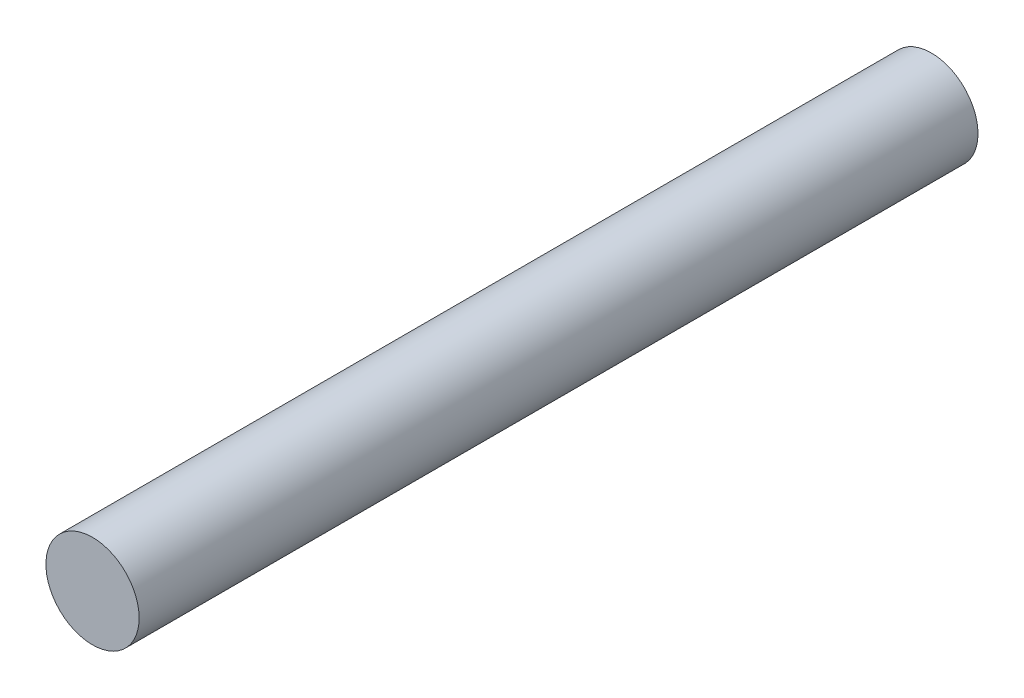
ISO-10303-21;
HEADER;
FILE_DESCRIPTION(('STEP AP214'),'2;1');
FILE_NAME('part.step','',(''),(''),'','','');
FILE_SCHEMA(('AUTOMOTIVE_DESIGN { 1 0 10303 214 1 1 1 1 }'));
ENDSEC;
DATA;
#1=APPLICATION_CONTEXT('core data for automotive mechanical design processes');
#2=APPLICATION_PROTOCOL_DEFINITION('international standard','automotive_design',2000,#1);
#3=PRODUCT_CONTEXT('',#1,'mechanical');
#4=PRODUCT('Part','Part','',(#3));
#5=PRODUCT_RELATED_PRODUCT_CATEGORY('part','',(#4));
#6=PRODUCT_DEFINITION_FORMATION('','',#4);
#7=PRODUCT_DEFINITION_CONTEXT('part definition',#1,'design');
#8=PRODUCT_DEFINITION('design','',#6,#7);
#9=PRODUCT_DEFINITION_SHAPE('','',#8);
#10=(LENGTH_UNIT() NAMED_UNIT(*) SI_UNIT(.MILLI.,.METRE.));
#11=(NAMED_UNIT(*) PLANE_ANGLE_UNIT() SI_UNIT($,.RADIAN.));
#12=(NAMED_UNIT(*) SI_UNIT($,.STERADIAN.) SOLID_ANGLE_UNIT());
#13=UNCERTAINTY_MEASURE_WITH_UNIT(LENGTH_MEASURE(1.E-05),#10,'distance_accuracy_value','');
#14=(GEOMETRIC_REPRESENTATION_CONTEXT(3) GLOBAL_UNCERTAINTY_ASSIGNED_CONTEXT((#13)) GLOBAL_UNIT_ASSIGNED_CONTEXT((#10,
#11,#12)) REPRESENTATION_CONTEXT('',''));
#15=CARTESIAN_POINT('',(0.,0.,0.));
#16=DIRECTION('',(0.,0.,1.));
#17=DIRECTION('',(1.,0.,0.));
#18=AXIS2_PLACEMENT_3D('',#15,#16,#17);
#19=CARTESIAN_POINT('',(0.,0.,18.));
#20=DIRECTION('',(0.,0.,-1.));
#21=DIRECTION('',(-1.,0.,0.));
#22=AXIS2_PLACEMENT_3D('',#19,#20,#21);
#23=CYLINDRICAL_SURFACE('',#22,1.);
#24=CARTESIAN_POINT('',(0.,0.,18.));
#25=DIRECTION('',(0.,0.,1.));
#26=DIRECTION('',(1.,0.,0.));
#27=AXIS2_PLACEMENT_3D('',#24,#25,#26);
#28=CIRCLE('',#27,1.);
#29=CARTESIAN_POINT('',(1.,0.,18.));
#30=VERTEX_POINT('',#29);
#31=EDGE_CURVE('E10',#30,#30,#28,.T.);
#32=ORIENTED_EDGE('',*,*,#31,.F.);
#33=EDGE_LOOP('',(#32));
#34=FACE_BOUND('',#33,.T.);
#35=CARTESIAN_POINT('',(0.,0.,0.));
#36=DIRECTION('',(0.,0.,1.));
#37=DIRECTION('',(1.,0.,0.));
#38=AXIS2_PLACEMENT_3D('',#35,#36,#37);
#39=CIRCLE('',#38,1.);
#40=CARTESIAN_POINT('',(1.,0.,0.));
#41=VERTEX_POINT('',#40);
#42=EDGE_CURVE('E40',#41,#41,#39,.T.);
#43=ORIENTED_EDGE('',*,*,#42,.T.);
#44=EDGE_LOOP('',(#43));
#45=FACE_BOUND('',#44,.T.);
#46=ADVANCED_FACE('F37',(#34,#45),#23,.T.);
#47=CARTESIAN_POINT('',(0.,0.,18.));
#48=DIRECTION('',(0.,0.,1.));
#49=DIRECTION('',(1.,0.,0.));
#50=AXIS2_PLACEMENT_3D('',#47,#48,#49);
#51=PLANE('',#50);
#52=ORIENTED_EDGE('',*,*,#31,.T.);
#53=EDGE_LOOP('',(#52));
#54=FACE_BOUND('',#53,.T.);
#55=ADVANCED_FACE('F54',(#54),#51,.T.);
#56=CARTESIAN_POINT('',(0.,0.,0.));
#57=DIRECTION('',(0.,0.,1.));
#58=DIRECTION('',(1.,0.,0.));
#59=AXIS2_PLACEMENT_3D('',#56,#57,#58);
#60=PLANE('',#59);
#61=ORIENTED_EDGE('',*,*,#42,.F.);
#62=EDGE_LOOP('',(#61));
#63=FACE_BOUND('',#62,.T.);
#64=ADVANCED_FACE('F52',(#63),#60,.F.);
#65=CLOSED_SHELL('',(#46,#55,#64));
#66=MANIFOLD_SOLID_BREP('B2',#65);
#67=ADVANCED_BREP_SHAPE_REPRESENTATION('',(#18,#66),#14);
#68=SHAPE_DEFINITION_REPRESENTATION(#9,#67);
ENDSEC;
END-ISO-10303-21;
